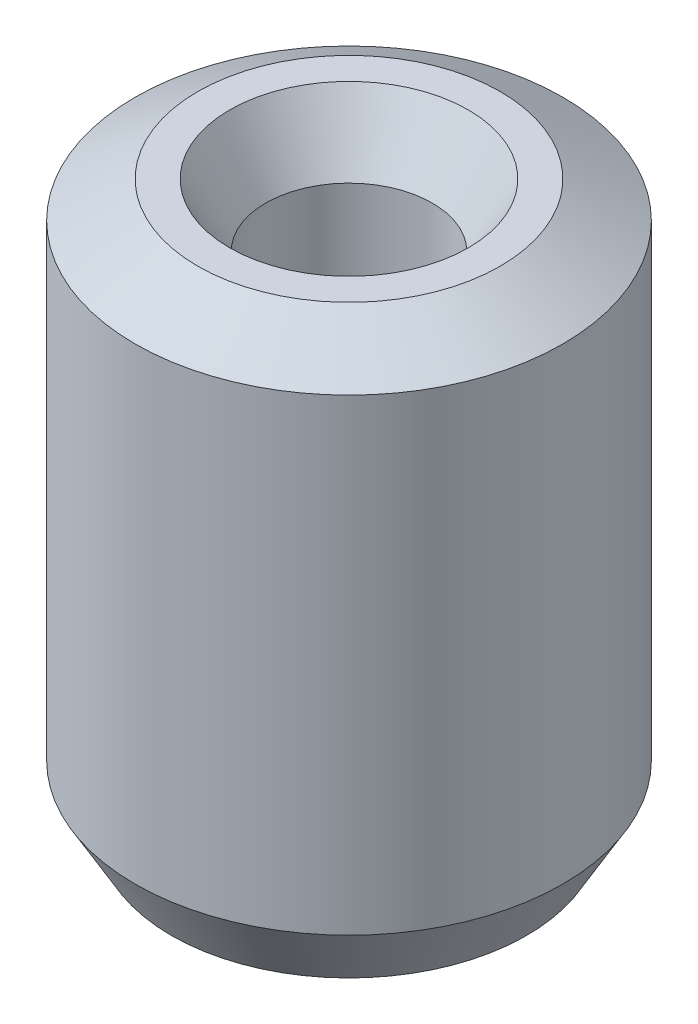
ISO-10303-21;
HEADER;
FILE_DESCRIPTION(('STEP AP214'),'2;1');
FILE_NAME('part.step','',(''),(''),'','','');
FILE_SCHEMA(('AUTOMOTIVE_DESIGN { 1 0 10303 214 1 1 1 1 }'));
ENDSEC;
DATA;
#1=APPLICATION_CONTEXT('core data for automotive mechanical design processes');
#2=APPLICATION_PROTOCOL_DEFINITION('international standard','automotive_design',2000,#1);
#3=PRODUCT_CONTEXT('',#1,'mechanical');
#4=PRODUCT('Part','Part','',(#3));
#5=PRODUCT_RELATED_PRODUCT_CATEGORY('part','',(#4));
#6=PRODUCT_DEFINITION_FORMATION('','',#4);
#7=PRODUCT_DEFINITION_CONTEXT('part definition',#1,'design');
#8=PRODUCT_DEFINITION('design','',#6,#7);
#9=PRODUCT_DEFINITION_SHAPE('','',#8);
#10=(LENGTH_UNIT() NAMED_UNIT(*) SI_UNIT(.MILLI.,.METRE.));
#11=(NAMED_UNIT(*) PLANE_ANGLE_UNIT() SI_UNIT($,.RADIAN.));
#12=(NAMED_UNIT(*) SI_UNIT($,.STERADIAN.) SOLID_ANGLE_UNIT());
#13=UNCERTAINTY_MEASURE_WITH_UNIT(LENGTH_MEASURE(1.E-05),#10,'distance_accuracy_value','');
#14=(GEOMETRIC_REPRESENTATION_CONTEXT(3) GLOBAL_UNCERTAINTY_ASSIGNED_CONTEXT((#13)) GLOBAL_UNIT_ASSIGNED_CONTEXT((#10,
#11,#12)) REPRESENTATION_CONTEXT('',''));
#15=CARTESIAN_POINT('',(0.,0.,0.));
#16=DIRECTION('',(0.,0.,1.));
#17=DIRECTION('',(1.,0.,0.));
#18=AXIS2_PLACEMENT_3D('',#15,#16,#17);
#19=CARTESIAN_POINT('',(0.,19.8698690281327,0.));
#20=DIRECTION('',(0.,-1.,0.));
#21=DIRECTION('',(0.,0.,-1.));
#22=AXIS2_PLACEMENT_3D('',#19,#20,#21);
#23=CYLINDRICAL_SURFACE('',#22,7.5);
#24=CARTESIAN_POINT('',(0.,2.19450498737683,0.));
#25=DIRECTION('',(0.,1.,0.));
#26=DIRECTION('',(0.,0.,1.));
#27=AXIS2_PLACEMENT_3D('',#24,#25,#26);
#28=CIRCLE('',#27,7.5);
#29=CARTESIAN_POINT('',(0.,2.19450498737683,7.5));
#30=VERTEX_POINT('',#29);
#31=EDGE_CURVE('E10',#30,#30,#28,.T.);
#32=ORIENTED_EDGE('',*,*,#31,.T.);
#33=EDGE_LOOP('',(#32));
#34=FACE_BOUND('',#33,.T.);
#35=CARTESIAN_POINT('',(0.,18.6028709829327,0.));
#36=DIRECTION('',(0.,1.,0.));
#37=DIRECTION('',(0.,0.,1.));
#38=AXIS2_PLACEMENT_3D('',#35,#36,#37);
#39=CIRCLE('',#38,7.5);
#40=CARTESIAN_POINT('',(0.,18.6028709829327,7.5));
#41=VERTEX_POINT('',#40);
#42=EDGE_CURVE('E50',#41,#41,#39,.F.);
#43=ORIENTED_EDGE('',*,*,#42,.T.);
#44=EDGE_LOOP('',(#43));
#45=FACE_BOUND('',#44,.T.);
#46=ADVANCED_FACE('F39',(#34,#45),#23,.T.);
#47=CARTESIAN_POINT('',(0.,19.8698690281327,0.));
#48=DIRECTION('',(0.,1.,0.));
#49=DIRECTION('',(0.,0.,1.));
#50=AXIS2_PLACEMENT_3D('',#47,#48,#49);
#51=PLANE('',#50);
#52=CARTESIAN_POINT('',(0.,19.8698690281327,0.));
#53=DIRECTION('',(0.,1.,0.));
#54=DIRECTION('',(0.,0.,1.));
#55=AXIS2_PLACEMENT_3D('',#52,#53,#54);
#56=CIRCLE('',#55,4.18860394068996);
#57=CARTESIAN_POINT('',(0.,19.8698690281327,4.18860394068996));
#58=VERTEX_POINT('',#57);
#59=EDGE_CURVE('E58',#58,#58,#56,.F.);
#60=ORIENTED_EDGE('',*,*,#59,.T.);
#61=EDGE_LOOP('',(#60));
#62=FACE_BOUND('',#61,.T.);
#63=CARTESIAN_POINT('',(0.,19.8698690281327,0.));
#64=DIRECTION('',(0.,1.,0.));
#65=DIRECTION('',(0.,0.,1.));
#66=AXIS2_PLACEMENT_3D('',#63,#64,#65);
#67=CIRCLE('',#66,5.30549501262318);
#68=CARTESIAN_POINT('',(0.,19.8698690281327,5.30549501262318));
#69=VERTEX_POINT('',#68);
#70=EDGE_CURVE('E61',#69,#69,#67,.T.);
#71=ORIENTED_EDGE('',*,*,#70,.T.);
#72=EDGE_LOOP('',(#71));
#73=FACE_BOUND('',#72,.T.);
#74=ADVANCED_FACE('F88',(#62,#73),#51,.T.);
#75=CARTESIAN_POINT('',(0.,0.,0.));
#76=DIRECTION('',(0.,1.,0.));
#77=DIRECTION('',(0.,0.,1.));
#78=AXIS2_PLACEMENT_3D('',#75,#76,#77);
#79=PLANE('',#78);
#80=CARTESIAN_POINT('',(0.,0.,0.));
#81=DIRECTION('',(0.,1.,0.));
#82=DIRECTION('',(0.,0.,1.));
#83=AXIS2_PLACEMENT_3D('',#80,#81,#82);
#84=CIRCLE('',#83,5.11611088286678);
#85=CARTESIAN_POINT('',(0.,0.,5.11611088286678));
#86=VERTEX_POINT('',#85);
#87=EDGE_CURVE('E51',#86,#86,#84,.T.);
#88=ORIENTED_EDGE('',*,*,#87,.T.);
#89=EDGE_LOOP('',(#88));
#90=FACE_BOUND('',#89,.T.);
#91=CARTESIAN_POINT('',(0.,0.,0.));
#92=DIRECTION('',(0.,1.,0.));
#93=DIRECTION('',(0.,0.,1.));
#94=AXIS2_PLACEMENT_3D('',#91,#92,#93);
#95=CIRCLE('',#94,6.2330019548);
#96=CARTESIAN_POINT('',(0.,0.,6.2330019548));
#97=VERTEX_POINT('',#96);
#98=EDGE_CURVE('E54',#97,#97,#95,.F.);
#99=ORIENTED_EDGE('',*,*,#98,.T.);
#100=EDGE_LOOP('',(#99));
#101=FACE_BOUND('',#100,.T.);
#102=ADVANCED_FACE('F83',(#90,#101),#79,.F.);
#103=CARTESIAN_POINT('',(0.,19.8698690281327,0.));
#104=DIRECTION('',(0.,-1.,0.));
#105=DIRECTION('',(0.,0.,-1.));
#106=AXIS2_PLACEMENT_3D('',#103,#104,#105);
#107=CYLINDRICAL_SURFACE('',#106,2.92160589548996);
#108=CARTESIAN_POINT('',(0.,17.6753640407559,0.));
#109=DIRECTION('',(0.,1.,0.));
#110=DIRECTION('',(0.,0.,1.));
#111=AXIS2_PLACEMENT_3D('',#108,#109,#110);
#112=CIRCLE('',#111,2.92160589548996);
#113=CARTESIAN_POINT('',(0.,17.6753640407559,2.92160589548996));
#114=VERTEX_POINT('',#113);
#115=EDGE_CURVE('E67',#114,#114,#112,.T.);
#116=ORIENTED_EDGE('',*,*,#115,.T.);
#117=EDGE_LOOP('',(#116));
#118=FACE_BOUND('',#117,.T.);
#119=CARTESIAN_POINT('',(0.,1.26699804519999,0.));
#120=DIRECTION('',(0.,1.,0.));
#121=DIRECTION('',(0.,0.,1.));
#122=AXIS2_PLACEMENT_3D('',#119,#120,#121);
#123=CIRCLE('',#122,2.92160589548996);
#124=CARTESIAN_POINT('',(0.,1.26699804519999,2.92160589548996));
#125=VERTEX_POINT('',#124);
#126=EDGE_CURVE('E69',#125,#125,#123,.F.);
#127=ORIENTED_EDGE('',*,*,#126,.T.);
#128=EDGE_LOOP('',(#127));
#129=FACE_BOUND('',#128,.T.);
#130=ADVANCED_FACE('F71',(#118,#129),#107,.F.);
#131=CARTESIAN_POINT('',(0.,17.6753640407559,0.));
#132=DIRECTION('',(0.,1.,0.));
#133=DIRECTION('',(0.,0.,1.));
#134=AXIS2_PLACEMENT_3D('',#131,#132,#133);
#135=CONICAL_SURFACE('',#134,2.92160589548996,0.523598775598301);
#136=ORIENTED_EDGE('',*,*,#59,.F.);
#137=EDGE_LOOP('',(#136));
#138=FACE_BOUND('',#137,.T.);
#139=ORIENTED_EDGE('',*,*,#115,.F.);
#140=EDGE_LOOP('',(#139));
#141=FACE_BOUND('',#140,.T.);
#142=ADVANCED_FACE('F77',(#138,#141),#135,.F.);
#143=CARTESIAN_POINT('',(0.,0.,0.));
#144=DIRECTION('',(0.,-1.,0.));
#145=DIRECTION('',(0.,0.,-1.));
#146=AXIS2_PLACEMENT_3D('',#143,#144,#145);
#147=CONICAL_SURFACE('',#146,5.11611088286678,1.04719755119659);
#148=ORIENTED_EDGE('',*,*,#126,.F.);
#149=EDGE_LOOP('',(#148));
#150=FACE_BOUND('',#149,.T.);
#151=ORIENTED_EDGE('',*,*,#87,.F.);
#152=EDGE_LOOP('',(#151));
#153=FACE_BOUND('',#152,.T.);
#154=ADVANCED_FACE('F73',(#150,#153),#147,.F.);
#155=CARTESIAN_POINT('',(0.,2.19450498737683,0.));
#156=DIRECTION('',(0.,1.,0.));
#157=DIRECTION('',(0.,0.,1.));
#158=AXIS2_PLACEMENT_3D('',#155,#156,#157);
#159=CONICAL_SURFACE('',#158,7.5,0.523598775598303);
#160=ORIENTED_EDGE('',*,*,#98,.F.);
#161=EDGE_LOOP('',(#160));
#162=FACE_BOUND('',#161,.T.);
#163=ORIENTED_EDGE('',*,*,#31,.F.);
#164=EDGE_LOOP('',(#163));
#165=FACE_BOUND('',#164,.T.);
#166=ADVANCED_FACE('F76',(#162,#165),#159,.T.);
#167=CARTESIAN_POINT('',(0.,19.8698690281327,0.));
#168=DIRECTION('',(0.,-1.,0.));
#169=DIRECTION('',(0.,0.,-1.));
#170=AXIS2_PLACEMENT_3D('',#167,#168,#169);
#171=CONICAL_SURFACE('',#170,5.30549501262318,1.04719755119659);
#172=ORIENTED_EDGE('',*,*,#42,.F.);
#173=EDGE_LOOP('',(#172));
#174=FACE_BOUND('',#173,.T.);
#175=ORIENTED_EDGE('',*,*,#70,.F.);
#176=EDGE_LOOP('',(#175));
#177=FACE_BOUND('',#176,.T.);
#178=ADVANCED_FACE('F45',(#174,#177),#171,.T.);
#179=CLOSED_SHELL('',(#46,#74,#102,#130,#142,#154,#166,#178));
#180=MANIFOLD_SOLID_BREP('B2',#179);
#181=ADVANCED_BREP_SHAPE_REPRESENTATION('',(#18,#180),#14);
#182=SHAPE_DEFINITION_REPRESENTATION(#9,#181);
ENDSEC;
END-ISO-10303-21;
